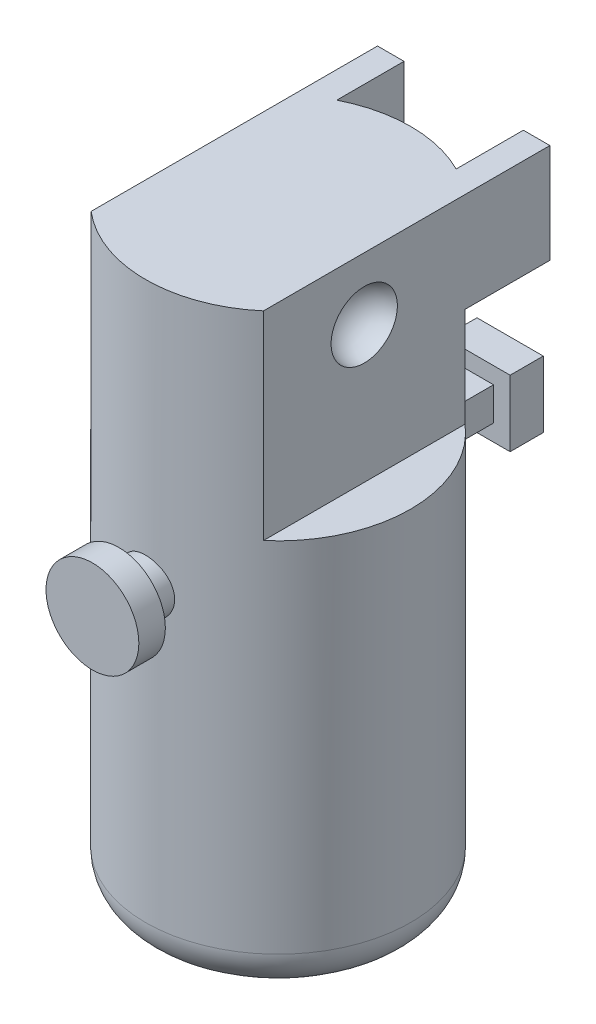
ISO-10303-21;
HEADER;
FILE_DESCRIPTION(('STEP AP214'),'2;1');
FILE_NAME('part.step','',(''),(''),'','','');
FILE_SCHEMA(('AUTOMOTIVE_DESIGN { 1 0 10303 214 1 1 1 1 }'));
ENDSEC;
DATA;
#1=APPLICATION_CONTEXT('core data for automotive mechanical design processes');
#2=APPLICATION_PROTOCOL_DEFINITION('international standard','automotive_design',2000,#1);
#3=PRODUCT_CONTEXT('',#1,'mechanical');
#4=PRODUCT('Part','Part','',(#3));
#5=PRODUCT_RELATED_PRODUCT_CATEGORY('part','',(#4));
#6=PRODUCT_DEFINITION_FORMATION('','',#4);
#7=PRODUCT_DEFINITION_CONTEXT('part definition',#1,'design');
#8=PRODUCT_DEFINITION('design','',#6,#7);
#9=PRODUCT_DEFINITION_SHAPE('','',#8);
#10=(LENGTH_UNIT() NAMED_UNIT(*) SI_UNIT(.MILLI.,.METRE.));
#11=(NAMED_UNIT(*) PLANE_ANGLE_UNIT() SI_UNIT($,.RADIAN.));
#12=(NAMED_UNIT(*) SI_UNIT($,.STERADIAN.) SOLID_ANGLE_UNIT());
#13=UNCERTAINTY_MEASURE_WITH_UNIT(LENGTH_MEASURE(1.E-05),#10,'distance_accuracy_value','');
#14=(GEOMETRIC_REPRESENTATION_CONTEXT(3) GLOBAL_UNCERTAINTY_ASSIGNED_CONTEXT((#13)) GLOBAL_UNIT_ASSIGNED_CONTEXT((#10,
#11,#12)) REPRESENTATION_CONTEXT('',''));
#15=CARTESIAN_POINT('',(0.,0.,0.));
#16=DIRECTION('',(0.,0.,1.));
#17=DIRECTION('',(1.,0.,0.));
#18=AXIS2_PLACEMENT_3D('',#15,#16,#17);
#19=CARTESIAN_POINT('',(0.,45.,0.));
#20=DIRECTION('',(0.,-1.,0.));
#21=DIRECTION('',(0.,0.,-1.));
#22=AXIS2_PLACEMENT_3D('',#19,#20,#21);
#23=CYLINDRICAL_SURFACE('',#22,10.);
#24=CARTESIAN_POINT('',(-2.,25.,9.79795897113271));
#25=CARTESIAN_POINT('',(-1.99999589175055,24.8888712490177,9.79796118053292));
#26=CARTESIAN_POINT('',(-1.99070634343629,24.7776907533333,9.79987016537404));
#27=CARTESIAN_POINT('',(-1.95382456716569,24.5584749897137,9.80728862609749));
#28=CARTESIAN_POINT('',(-1.92621769414099,24.450442310728,9.81280098289574));
#29=CARTESIAN_POINT('',(-1.85359156523949,24.2407253932916,9.82677747443709));
#30=CARTESIAN_POINT('',(-1.80858962830524,24.1390349569348,9.83523867242151));
#31=CARTESIAN_POINT('',(-1.70249821534101,23.9446503106061,9.85415598961317));
#32=CARTESIAN_POINT('',(-1.64140963720231,23.8519555989242,9.86461199746922));
#33=CARTESIAN_POINT('',(-1.50395815130688,23.6768779922923,9.88650599388505));
#34=CARTESIAN_POINT('',(-1.42741131182664,23.5946408242321,9.89795475674493));
#35=CARTESIAN_POINT('',(-1.26161357804262,23.444084932842,9.92044944605197));
#36=CARTESIAN_POINT('',(-1.17236179395597,23.3757671851656,9.93149534421663));
#37=CARTESIAN_POINT('',(-0.982722711848513,23.2544239647431,9.95205592835124));
#38=CARTESIAN_POINT('',(-0.882245135344422,23.2015369723667,9.96155642883101));
#39=CARTESIAN_POINT('',(-0.673608300774544,23.1134501259037,9.97783473767263));
#40=CARTESIAN_POINT('',(-0.565449762841107,23.078248616198,9.98461280088238));
#41=CARTESIAN_POINT('',(-0.346033546556989,23.0269856127607,9.99460641376837));
#42=CARTESIAN_POINT('',(-0.234835478429629,23.010678044858,9.99786772576254));
#43=CARTESIAN_POINT('',(-0.0112371368750724,22.9968980963234,10.0006184236721));
#44=CARTESIAN_POINT('',(0.101163019663687,22.9994239007084,10.0001081730552));
#45=CARTESIAN_POINT('',(0.322284001487178,23.0230523604311,9.99540869737031));
#46=CARTESIAN_POINT('',(0.431034428596941,23.0438899543357,9.99127196731677));
#47=CARTESIAN_POINT('',(0.643463253160604,23.1031300649178,9.97984354318817));
#48=CARTESIAN_POINT('',(0.74714144749426,23.1415332843837,9.97255172288078));
#49=CARTESIAN_POINT('',(0.947238926401776,23.2350600802945,9.95554592039917));
#50=CARTESIAN_POINT('',(1.0436083482678,23.2902875022098,9.94581696350447));
#51=CARTESIAN_POINT('',(1.22581009171951,23.4158181544732,9.92500938947571));
#52=CARTESIAN_POINT('',(1.31164119905,23.486123119541,9.91393061710444));
#53=CARTESIAN_POINT('',(1.47190286210692,23.6412672442169,9.89141928728919));
#54=CARTESIAN_POINT('',(1.54610863314726,23.7263383734592,9.87998392915032));
#55=CARTESIAN_POINT('',(1.67923698635362,23.9078328849015,9.85823143197521));
#56=CARTESIAN_POINT('',(1.7381592794555,24.0042564817664,9.84791431409096));
#57=CARTESIAN_POINT('',(1.83912562960377,24.2060416636436,9.82956094945847));
#58=CARTESIAN_POINT('',(1.88113329555542,24.3114219352793,9.82152963127098));
#59=CARTESIAN_POINT('',(1.94678068325517,24.527942647448,9.80872952642545));
#60=CARTESIAN_POINT('',(1.97042279891329,24.6390823352382,9.80396031456855));
#61=CARTESIAN_POINT('',(1.99833201207211,24.8619297159981,9.79830958535655));
#62=CARTESIAN_POINT('',(2.00292371779583,24.9735951486207,9.79736294114308));
#63=CARTESIAN_POINT('',(1.99347525662148,25.1960964463994,9.79928971377708));
#64=CARTESIAN_POINT('',(1.97943614624489,25.3069323582377,9.80216291400776));
#65=CARTESIAN_POINT('',(1.93340441614832,25.5235372805845,9.81134464989829));
#66=CARTESIAN_POINT('',(1.9015852416786,25.6293446860715,9.81761998028993));
#67=CARTESIAN_POINT('',(1.82108207061704,25.8341265580575,9.83286978703329));
#68=CARTESIAN_POINT('',(1.77239668474636,25.9331004608714,9.84184448572539));
#69=CARTESIAN_POINT('',(1.6588082844312,26.1228262199003,9.86162811924079));
#70=CARTESIAN_POINT('',(1.59370215596551,26.2134540926017,9.87245943729806));
#71=CARTESIAN_POINT('',(1.44939114442543,26.3826166240018,9.89467447653273));
#72=CARTESIAN_POINT('',(1.37018481028908,26.4611500364985,9.90605825447636));
#73=CARTESIAN_POINT('',(1.19846454699578,26.6051251183712,9.92830691738431));
#74=CARTESIAN_POINT('',(1.10576499785926,26.6703473093,9.93916115417367));
#75=CARTESIAN_POINT('',(0.910535793269509,26.7842917629992,9.9589425525724));
#76=CARTESIAN_POINT('',(0.808006550867012,26.8330147186896,9.96786979510422));
#77=CARTESIAN_POINT('',(0.596605361648025,26.9122577434933,9.98274588122133));
#78=CARTESIAN_POINT('',(0.487773346956155,26.9428810364525,9.98871158285205));
#79=CARTESIAN_POINT('',(0.266378909359822,26.9853824953277,9.99706471875323));
#80=CARTESIAN_POINT('',(0.153816937422423,26.9972629189514,9.99945258399698));
#81=CARTESIAN_POINT('',(-0.0697457878072434,27.0018539619258,10.0003708090823));
#82=CARTESIAN_POINT('',(-0.18073962428299,26.9948945609125,9.99896757098659));
#83=CARTESIAN_POINT('',(-0.399942062631302,26.9627320989043,9.99260087120678));
#84=CARTESIAN_POINT('',(-0.508150699507447,26.9375292673037,9.98763745428862));
#85=CARTESIAN_POINT('',(-0.718505499490131,26.8697420158168,9.97470996729841));
#86=CARTESIAN_POINT('',(-0.82066488648033,26.8271972437381,9.9667527449523));
#87=CARTESIAN_POINT('',(-1.01644244037214,26.7259755173378,9.9486944424736));
#88=CARTESIAN_POINT('',(-1.11005993153569,26.667297288191,9.93859319293976));
#89=CARTESIAN_POINT('',(-1.28772778021183,26.5343612258774,9.91715198313481));
#90=CARTESIAN_POINT('',(-1.37159943222968,26.4598673272325,9.90579466835802));
#91=CARTESIAN_POINT('',(-1.52576523551701,26.2978995198025,9.8832244581573));
#92=CARTESIAN_POINT('',(-1.59605616641783,26.2104225410401,9.87201159757438));
#93=CARTESIAN_POINT('',(-1.72178443889997,26.0238413666191,9.85086685467863));
#94=CARTESIAN_POINT('',(-1.77705362923618,25.9246220777575,9.84095007142451));
#95=CARTESIAN_POINT('',(-1.87004809853246,25.7181344534798,9.82370474252826));
#96=CARTESIAN_POINT('',(-1.90778929194833,25.6108735226256,9.81637385049968));
#97=CARTESIAN_POINT('',(-1.95733827971531,25.4194750891142,9.8065936227569));
#98=CARTESIAN_POINT('',(-1.97330779704737,25.3364291609721,9.80337569829212));
#99=CARTESIAN_POINT('',(-1.99464003591942,25.1689320908977,9.79905756918169));
#100=CARTESIAN_POINT('',(-2.00000312312529,25.0844809975111,9.79795729152836));
#101=CARTESIAN_POINT('',(-2.,25.,9.79795897113271));
#102=B_SPLINE_CURVE_WITH_KNOTS('',3,(#24,#25,#26,#27,#28,#29,#30,#31,#32,#33,#34,#35,#36,#37,
#38,#39,#40,#41,#42,#43,#44,#45,#46,#47,#48,#49,#50,#51,#52,#53,#54,#55,#56,#57,#58,#59,#60,#61,
#62,#63,#64,#65,#66,#67,#68,#69,#70,#71,#72,#73,#74,#75,#76,#77,#78,#79,#80,#81,#82,#83,#84,#85,
#86,#87,#88,#89,#90,#91,#92,#93,#94,#95,#96,#97,#98,#99,#100,#101),.UNSPECIFIED.,.T.,.F.,(4,2,2,
2,2,2,2,2,2,2,2,2,2,2,2,2,2,2,2,2,2,2,2,2,2,2,2,2,2,2,2,2,2,2,2,2,2,2,4),(0.,0.333076927738854,
0.666420478568594,0.999432995881169,1.33242692971973,1.66964505096874,2.00688680070844,
2.34706800874901,2.6872173649312,3.02288497766161,3.35852024232497,3.68937579267076,
4.02024458147501,4.35319848444607,4.68619071540133,5.02498693524967,5.36378956245441,
5.70331726345554,6.0428007003205,6.37647515609188,6.71013069056844,7.04058683566639,
7.37107020708798,7.70586119549044,8.04068665740419,8.38065203466903,8.72060313260211,
9.05859627157302,9.39654869383257,9.72862034829374,10.0606878273352,10.3920003415091,
10.7233390426937,11.0600230405119,11.3967867777956,11.7371779715922,12.077259501804,
12.3304760727633,12.5836839137096),.UNSPECIFIED.);
#103=CARTESIAN_POINT('',(-2.,25.,9.79795897113271));
#104=VERTEX_POINT('',#103);
#105=EDGE_CURVE('E409',#104,#104,#102,.T.);
#106=ORIENTED_EDGE('',*,*,#105,.F.);
#107=EDGE_LOOP('',(#106));
#108=FACE_BOUND('',#107,.T.);
#109=CARTESIAN_POINT('',(0.,3.,0.));
#110=DIRECTION('',(0.,1.,0.));
#111=DIRECTION('',(0.,0.,1.));
#112=AXIS2_PLACEMENT_3D('',#109,#110,#111);
#113=CIRCLE('',#112,10.);
#114=CARTESIAN_POINT('',(0.,3.,10.));
#115=VERTEX_POINT('',#114);
#116=EDGE_CURVE('E401',#115,#115,#113,.T.);
#117=ORIENTED_EDGE('',*,*,#116,.T.);
#118=EDGE_LOOP('',(#117));
#119=FACE_BOUND('',#118,.T.);
#120=DIRECTION('',(0.,-1.,0.));
#121=VECTOR('',#120,1.);
#122=CARTESIAN_POINT('',(-1.25,45.,-9.92156741649221));
#123=LINE('',#122,#121);
#124=CARTESIAN_POINT('',(-1.25,23.75,-9.92156741649221));
#125=VERTEX_POINT('',#124);
#126=CARTESIAN_POINT('',(-1.25,26.25,-9.92156741649221));
#127=VERTEX_POINT('',#126);
#128=EDGE_CURVE('E324',#125,#127,#123,.F.);
#129=ORIENTED_EDGE('',*,*,#128,.F.);
#130=CARTESIAN_POINT('',(0.,23.75,0.));
#131=DIRECTION('',(0.,1.,0.));
#132=DIRECTION('',(0.,0.,1.));
#133=AXIS2_PLACEMENT_3D('',#130,#131,#132);
#134=CIRCLE('',#133,10.);
#135=CARTESIAN_POINT('',(1.25,23.75,-9.92156741649221));
#136=VERTEX_POINT('',#135);
#137=EDGE_CURVE('E319',#125,#136,#134,.F.);
#138=ORIENTED_EDGE('',*,*,#137,.T.);
#139=DIRECTION('',(0.,-1.,0.));
#140=VECTOR('',#139,1.);
#141=CARTESIAN_POINT('',(1.25,45.,-9.92156741649221));
#142=LINE('',#141,#140);
#143=CARTESIAN_POINT('',(1.25,26.25,-9.92156741649221));
#144=VERTEX_POINT('',#143);
#145=EDGE_CURVE('E315',#136,#144,#142,.F.);
#146=ORIENTED_EDGE('',*,*,#145,.T.);
#147=CARTESIAN_POINT('',(0.,26.25,0.));
#148=DIRECTION('',(0.,1.,0.));
#149=DIRECTION('',(0.,0.,1.));
#150=AXIS2_PLACEMENT_3D('',#147,#148,#149);
#151=CIRCLE('',#150,10.);
#152=EDGE_CURVE('E320',#127,#144,#151,.F.);
#153=ORIENTED_EDGE('',*,*,#152,.F.);
#154=EDGE_LOOP('',(#129,#138,#146,#153));
#155=FACE_BOUND('',#154,.T.);
#156=CARTESIAN_POINT('',(0.,37.5,0.));
#157=DIRECTION('',(0.,1.,0.));
#158=DIRECTION('',(0.,0.,1.));
#159=AXIS2_PLACEMENT_3D('',#156,#157,#158);
#160=CIRCLE('',#159,10.);
#161=CARTESIAN_POINT('',(-4.5,37.5,-8.93028554974587));
#162=VERTEX_POINT('',#161);
#163=CARTESIAN_POINT('',(-6.5,37.5,-7.59934207678533));
#164=VERTEX_POINT('',#163);
#165=EDGE_CURVE('E13',#162,#164,#160,.T.);
#166=ORIENTED_EDGE('',*,*,#165,.F.);
#167=DIRECTION('',(0.,-1.,0.));
#168=VECTOR('',#167,1.);
#169=CARTESIAN_POINT('',(-4.5,45.,-8.93028554974587));
#170=LINE('',#169,#168);
#171=CARTESIAN_POINT('',(-4.5,45.,-8.93028554974588));
#172=VERTEX_POINT('',#171);
#173=EDGE_CURVE('E88',#172,#162,#170,.T.);
#174=ORIENTED_EDGE('',*,*,#173,.F.);
#175=CARTESIAN_POINT('',(0.,45.,0.));
#176=DIRECTION('',(0.,1.,0.));
#177=DIRECTION('',(0.,0.,1.));
#178=AXIS2_PLACEMENT_3D('',#175,#176,#177);
#179=CIRCLE('',#178,10.);
#180=CARTESIAN_POINT('',(4.5,45.,-8.93028554974588));
#181=VERTEX_POINT('',#180);
#182=EDGE_CURVE('E218',#181,#172,#179,.T.);
#183=ORIENTED_EDGE('',*,*,#182,.F.);
#184=DIRECTION('',(0.,-1.,0.));
#185=VECTOR('',#184,1.);
#186=CARTESIAN_POINT('',(4.5,45.,-8.93028554974587));
#187=LINE('',#186,#185);
#188=CARTESIAN_POINT('',(4.5,37.5,-8.93028554974588));
#189=VERTEX_POINT('',#188);
#190=EDGE_CURVE('E256',#189,#181,#187,.F.);
#191=ORIENTED_EDGE('',*,*,#190,.F.);
#192=CARTESIAN_POINT('',(0.,37.5,0.));
#193=DIRECTION('',(0.,-1.,0.));
#194=DIRECTION('',(0.,0.,-1.));
#195=AXIS2_PLACEMENT_3D('',#192,#193,#194);
#196=CIRCLE('',#195,10.);
#197=CARTESIAN_POINT('',(6.5,37.5,-7.59934207678533));
#198=VERTEX_POINT('',#197);
#199=EDGE_CURVE('E79',#189,#198,#196,.T.);
#200=ORIENTED_EDGE('',*,*,#199,.T.);
#201=DIRECTION('',(0.,-1.,0.));
#202=VECTOR('',#201,1.);
#203=CARTESIAN_POINT('',(6.5,45.,-7.59934207678533));
#204=LINE('',#203,#202);
#205=CARTESIAN_POINT('',(6.5,30.,-7.59934207678533));
#206=VERTEX_POINT('',#205);
#207=EDGE_CURVE('E367',#206,#198,#204,.F.);
#208=ORIENTED_EDGE('',*,*,#207,.F.);
#209=CARTESIAN_POINT('',(0.,30.,0.));
#210=DIRECTION('',(0.,1.,0.));
#211=DIRECTION('',(0.,0.,1.));
#212=AXIS2_PLACEMENT_3D('',#209,#210,#211);
#213=CIRCLE('',#212,10.);
#214=CARTESIAN_POINT('',(6.5,30.,7.59934207678533));
#215=VERTEX_POINT('',#214);
#216=EDGE_CURVE('E391',#215,#206,#213,.T.);
#217=ORIENTED_EDGE('',*,*,#216,.F.);
#218=DIRECTION('',(0.,-1.,0.));
#219=VECTOR('',#218,1.);
#220=CARTESIAN_POINT('',(6.5,45.,7.59934207678533));
#221=LINE('',#220,#219);
#222=CARTESIAN_POINT('',(6.5,45.,7.59934207678533));
#223=VERTEX_POINT('',#222);
#224=EDGE_CURVE('E371',#223,#215,#221,.T.);
#225=ORIENTED_EDGE('',*,*,#224,.F.);
#226=CARTESIAN_POINT('',(-6.5,45.,7.59934207678533));
#227=VERTEX_POINT('',#226);
#228=EDGE_CURVE('E381',#227,#223,#179,.T.);
#229=ORIENTED_EDGE('',*,*,#228,.F.);
#230=DIRECTION('',(0.,-1.,0.));
#231=VECTOR('',#230,1.);
#232=CARTESIAN_POINT('',(-6.5,45.,7.59934207678533));
#233=LINE('',#232,#231);
#234=CARTESIAN_POINT('',(-6.5,30.,7.59934207678533));
#235=VERTEX_POINT('',#234);
#236=EDGE_CURVE('E377',#227,#235,#233,.T.);
#237=ORIENTED_EDGE('',*,*,#236,.T.);
#238=CARTESIAN_POINT('',(-6.5,30.,-7.59934207678533));
#239=VERTEX_POINT('',#238);
#240=EDGE_CURVE('E394',#239,#235,#213,.T.);
#241=ORIENTED_EDGE('',*,*,#240,.F.);
#242=DIRECTION('',(0.,-1.,0.));
#243=VECTOR('',#242,1.);
#244=CARTESIAN_POINT('',(-6.5,45.,-7.59934207678533));
#245=LINE('',#244,#243);
#246=EDGE_CURVE('E374',#239,#164,#245,.F.);
#247=ORIENTED_EDGE('',*,*,#246,.T.);
#248=EDGE_LOOP('',(#166,#174,#183,#191,#200,#208,#217,#225,#229,#237,#241,#247));
#249=FACE_BOUND('',#248,.T.);
#250=ADVANCED_FACE('F70',(#108,#119,#155,#249),#23,.T.);
#251=CARTESIAN_POINT('',(0.,45.,0.));
#252=DIRECTION('',(0.,1.,0.));
#253=DIRECTION('',(0.,0.,1.));
#254=AXIS2_PLACEMENT_3D('',#251,#252,#253);
#255=PLANE('',#254);
#256=ORIENTED_EDGE('',*,*,#182,.T.);
#257=DIRECTION('',(0.,0.,1.));
#258=VECTOR('',#257,1.);
#259=CARTESIAN_POINT('',(-4.5,45.,-14.));
#260=LINE('',#259,#258);
#261=CARTESIAN_POINT('',(-4.5,45.,-14.));
#262=VERTEX_POINT('',#261);
#263=EDGE_CURVE('E197',#262,#172,#260,.T.);
#264=ORIENTED_EDGE('',*,*,#263,.F.);
#265=DIRECTION('',(-1.,0.,0.));
#266=VECTOR('',#265,1.);
#267=CARTESIAN_POINT('',(-4.5,45.,-14.));
#268=LINE('',#267,#266);
#269=CARTESIAN_POINT('',(-6.5,45.,-14.));
#270=VERTEX_POINT('',#269);
#271=EDGE_CURVE('E207',#262,#270,#268,.T.);
#272=ORIENTED_EDGE('',*,*,#271,.T.);
#273=DIRECTION('',(0.,0.,-1.));
#274=VECTOR('',#273,1.);
#275=CARTESIAN_POINT('',(-6.5,45.,0.));
#276=LINE('',#275,#274);
#277=EDGE_CURVE('E388',#227,#270,#276,.T.);
#278=ORIENTED_EDGE('',*,*,#277,.F.);
#279=ORIENTED_EDGE('',*,*,#228,.T.);
#280=DIRECTION('',(0.,0.,-1.));
#281=VECTOR('',#280,1.);
#282=CARTESIAN_POINT('',(6.5,45.,0.));
#283=LINE('',#282,#281);
#284=CARTESIAN_POINT('',(6.5,45.,-14.));
#285=VERTEX_POINT('',#284);
#286=EDGE_CURVE('E385',#223,#285,#283,.T.);
#287=ORIENTED_EDGE('',*,*,#286,.T.);
#288=DIRECTION('',(1.,0.,0.));
#289=VECTOR('',#288,1.);
#290=CARTESIAN_POINT('',(4.5,45.,-14.));
#291=LINE('',#290,#289);
#292=CARTESIAN_POINT('',(4.5,45.,-14.));
#293=VERTEX_POINT('',#292);
#294=EDGE_CURVE('E252',#293,#285,#291,.T.);
#295=ORIENTED_EDGE('',*,*,#294,.F.);
#296=DIRECTION('',(0.,0.,1.));
#297=VECTOR('',#296,1.);
#298=CARTESIAN_POINT('',(4.5,45.,-14.));
#299=LINE('',#298,#297);
#300=EDGE_CURVE('E234',#293,#181,#299,.T.);
#301=ORIENTED_EDGE('',*,*,#300,.T.);
#302=EDGE_LOOP('',(#256,#264,#272,#278,#279,#287,#295,#301));
#303=FACE_BOUND('',#302,.T.);
#304=ADVANCED_FACE('F216',(#303),#255,.T.);
#305=CARTESIAN_POINT('',(0.,0.,0.));
#306=DIRECTION('',(0.,1.,0.));
#307=DIRECTION('',(0.,0.,1.));
#308=AXIS2_PLACEMENT_3D('',#305,#306,#307);
#309=PLANE('',#308);
#310=CARTESIAN_POINT('',(0.,0.,0.));
#311=DIRECTION('',(0.,1.,0.));
#312=DIRECTION('',(0.,0.,1.));
#313=AXIS2_PLACEMENT_3D('',#310,#311,#312);
#314=CIRCLE('',#313,7.);
#315=CARTESIAN_POINT('',(0.,0.,7.));
#316=VERTEX_POINT('',#315);
#317=EDGE_CURVE('E405',#316,#316,#314,.F.);
#318=ORIENTED_EDGE('',*,*,#317,.T.);
#319=EDGE_LOOP('',(#318));
#320=FACE_BOUND('',#319,.T.);
#321=ADVANCED_FACE('F483',(#320),#309,.F.);
#322=CARTESIAN_POINT('',(6.5,30.,10.));
#323=DIRECTION('',(1.,0.,0.));
#324=DIRECTION('',(0.,0.,-1.));
#325=AXIS2_PLACEMENT_3D('',#322,#323,#324);
#326=PLANE('',#325);
#327=CARTESIAN_POINT('',(6.5,40.2924092014202,0.));
#328=DIRECTION('',(1.,0.,0.));
#329=DIRECTION('',(0.,0.,-1.));
#330=AXIS2_PLACEMENT_3D('',#327,#328,#329);
#331=CIRCLE('',#330,2.5);
#332=CARTESIAN_POINT('',(6.5,40.2924092014202,-2.5));
#333=VERTEX_POINT('',#332);
#334=EDGE_CURVE('E348',#333,#333,#331,.T.);
#335=ORIENTED_EDGE('',*,*,#334,.F.);
#336=EDGE_LOOP('',(#335));
#337=FACE_BOUND('',#336,.T.);
#338=ORIENTED_EDGE('',*,*,#224,.T.);
#339=DIRECTION('',(0.,0.,-1.));
#340=VECTOR('',#339,1.);
#341=CARTESIAN_POINT('',(6.5,30.,10.));
#342=LINE('',#341,#340);
#343=EDGE_CURVE('E358',#215,#206,#342,.T.);
#344=ORIENTED_EDGE('',*,*,#343,.T.);
#345=ORIENTED_EDGE('',*,*,#207,.T.);
#346=DIRECTION('',(0.,0.,-1.));
#347=VECTOR('',#346,1.);
#348=CARTESIAN_POINT('',(6.5,37.5,-14.));
#349=LINE('',#348,#347);
#350=CARTESIAN_POINT('',(6.5,37.5,-14.));
#351=VERTEX_POINT('',#350);
#352=EDGE_CURVE('E233',#198,#351,#349,.T.);
#353=ORIENTED_EDGE('',*,*,#352,.T.);
#354=DIRECTION('',(0.,1.,0.));
#355=VECTOR('',#354,1.);
#356=CARTESIAN_POINT('',(6.5,45.,-14.));
#357=LINE('',#356,#355);
#358=EDGE_CURVE('E238',#351,#285,#357,.T.);
#359=ORIENTED_EDGE('',*,*,#358,.T.);
#360=ORIENTED_EDGE('',*,*,#286,.F.);
#361=EDGE_LOOP('',(#338,#344,#345,#353,#359,#360));
#362=FACE_BOUND('',#361,.T.);
#363=ADVANCED_FACE('F479',(#337,#362),#326,.T.);
#364=CARTESIAN_POINT('',(0.,30.,0.));
#365=DIRECTION('',(0.,1.,0.));
#366=DIRECTION('',(0.,0.,1.));
#367=AXIS2_PLACEMENT_3D('',#364,#365,#366);
#368=PLANE('',#367);
#369=ORIENTED_EDGE('',*,*,#216,.T.);
#370=ORIENTED_EDGE('',*,*,#343,.F.);
#371=EDGE_LOOP('',(#369,#370));
#372=FACE_BOUND('',#371,.T.);
#373=ADVANCED_FACE('F482',(#372),#368,.T.);
#374=ORIENTED_EDGE('',*,*,#240,.T.);
#375=DIRECTION('',(0.,0.,-1.));
#376=VECTOR('',#375,1.);
#377=CARTESIAN_POINT('',(-6.5,30.,10.));
#378=LINE('',#377,#376);
#379=EDGE_CURVE('E362',#235,#239,#378,.T.);
#380=ORIENTED_EDGE('',*,*,#379,.T.);
#381=EDGE_LOOP('',(#374,#380));
#382=FACE_BOUND('',#381,.T.);
#383=ADVANCED_FACE('F477',(#382),#368,.T.);
#384=CARTESIAN_POINT('',(-6.5,30.,10.));
#385=DIRECTION('',(1.,0.,0.));
#386=DIRECTION('',(0.,0.,-1.));
#387=AXIS2_PLACEMENT_3D('',#384,#385,#386);
#388=PLANE('',#387);
#389=CARTESIAN_POINT('',(-6.5,40.2924092014202,0.));
#390=DIRECTION('',(1.,0.,0.));
#391=DIRECTION('',(0.,0.,-1.));
#392=AXIS2_PLACEMENT_3D('',#389,#390,#391);
#393=CIRCLE('',#392,2.5);
#394=CARTESIAN_POINT('',(-6.5,40.2924092014202,-2.5));
#395=VERTEX_POINT('',#394);
#396=EDGE_CURVE('E363',#395,#395,#393,.T.);
#397=ORIENTED_EDGE('',*,*,#396,.T.);
#398=EDGE_LOOP('',(#397));
#399=FACE_BOUND('',#398,.T.);
#400=ORIENTED_EDGE('',*,*,#277,.T.);
#401=DIRECTION('',(0.,1.,0.));
#402=VECTOR('',#401,1.);
#403=CARTESIAN_POINT('',(-6.5,45.,-14.));
#404=LINE('',#403,#402);
#405=CARTESIAN_POINT('',(-6.5,37.5,-14.));
#406=VERTEX_POINT('',#405);
#407=EDGE_CURVE('E210',#406,#270,#404,.T.);
#408=ORIENTED_EDGE('',*,*,#407,.F.);
#409=DIRECTION('',(0.,0.,-1.));
#410=VECTOR('',#409,1.);
#411=CARTESIAN_POINT('',(-6.5,37.5,-14.));
#412=LINE('',#411,#410);
#413=EDGE_CURVE('E220',#164,#406,#412,.T.);
#414=ORIENTED_EDGE('',*,*,#413,.F.);
#415=ORIENTED_EDGE('',*,*,#246,.F.);
#416=ORIENTED_EDGE('',*,*,#379,.F.);
#417=ORIENTED_EDGE('',*,*,#236,.F.);
#418=EDGE_LOOP('',(#400,#408,#414,#415,#416,#417));
#419=FACE_BOUND('',#418,.T.);
#420=ADVANCED_FACE('F473',(#399,#419),#388,.F.);
#421=CARTESIAN_POINT('',(-6.5,40.2924092014202,0.));
#422=DIRECTION('',(0.,1.,0.));
#423=DIRECTION('',(0.,0.,-1.));
#424=AXIS2_PLACEMENT_3D('',#421,#422,#423);
#425=SPHERICAL_SURFACE('',#424,2.5);
#426=CARTESIAN_POINT('',(-6.5,40.2924092014202,0.));
#427=DIRECTION('',(1.,0.,0.));
#428=DIRECTION('',(0.,0.,-1.));
#429=AXIS2_PLACEMENT_3D('',#426,#427,#428);
#430=SPHERICAL_SURFACE('',#429,2.5);
#431=ORIENTED_EDGE('',*,*,#396,.F.);
#432=EDGE_LOOP('',(#431));
#433=FACE_BOUND('',#432,.T.);
#434=ADVANCED_FACE('F469',(#433),#430,.F.);
#435=CARTESIAN_POINT('',(6.5,40.2924092014202,0.));
#436=DIRECTION('',(0.,1.,0.));
#437=DIRECTION('',(0.,0.,-1.));
#438=AXIS2_PLACEMENT_3D('',#435,#436,#437);
#439=SPHERICAL_SURFACE('',#438,2.5);
#440=CARTESIAN_POINT('',(6.5,40.2924092014202,0.));
#441=DIRECTION('',(1.,0.,0.));
#442=DIRECTION('',(0.,0.,-1.));
#443=AXIS2_PLACEMENT_3D('',#440,#441,#442);
#444=SPHERICAL_SURFACE('',#443,2.5);
#445=ORIENTED_EDGE('',*,*,#334,.T.);
#446=EDGE_LOOP('',(#445));
#447=FACE_BOUND('',#446,.T.);
#448=ADVANCED_FACE('F466',(#447),#444,.F.);
#449=CARTESIAN_POINT('',(0.,3.,0.));
#450=DIRECTION('',(0.,1.,0.));
#451=DIRECTION('',(0.,0.,1.));
#452=AXIS2_PLACEMENT_3D('',#449,#450,#451);
#453=TOROIDAL_SURFACE('',#452,7.,3.);
#454=ORIENTED_EDGE('',*,*,#317,.F.);
#455=EDGE_LOOP('',(#454));
#456=FACE_BOUND('',#455,.T.);
#457=ORIENTED_EDGE('',*,*,#116,.F.);
#458=EDGE_LOOP('',(#457));
#459=FACE_BOUND('',#458,.T.);
#460=ADVANCED_FACE('F72',(#456,#459),#453,.T.);
#461=CARTESIAN_POINT('',(-1.25,23.75,-15.));
#462=DIRECTION('',(0.,-1.,0.));
#463=DIRECTION('',(0.,0.,-1.));
#464=AXIS2_PLACEMENT_3D('',#461,#462,#463);
#465=PLANE('',#464);
#466=DIRECTION('',(0.,0.,1.));
#467=VECTOR('',#466,1.);
#468=CARTESIAN_POINT('',(1.25,23.75,-15.));
#469=LINE('',#468,#467);
#470=CARTESIAN_POINT('',(1.25,23.75,-15.));
#471=VERTEX_POINT('',#470);
#472=EDGE_CURVE('E344',#471,#136,#469,.T.);
#473=ORIENTED_EDGE('',*,*,#472,.T.);
#474=ORIENTED_EDGE('',*,*,#137,.F.);
#475=DIRECTION('',(0.,0.,1.));
#476=VECTOR('',#475,1.);
#477=CARTESIAN_POINT('',(-1.25,23.75,-15.));
#478=LINE('',#477,#476);
#479=CARTESIAN_POINT('',(-1.25,23.75,-15.));
#480=VERTEX_POINT('',#479);
#481=EDGE_CURVE('E345',#480,#125,#478,.T.);
#482=ORIENTED_EDGE('',*,*,#481,.F.);
#483=DIRECTION('',(1.,0.,0.));
#484=VECTOR('',#483,1.);
#485=CARTESIAN_POINT('',(-1.25,23.75,-15.));
#486=LINE('',#485,#484);
#487=EDGE_CURVE('E323',#480,#471,#486,.T.);
#488=ORIENTED_EDGE('',*,*,#487,.T.);
#489=EDGE_LOOP('',(#473,#474,#482,#488));
#490=FACE_BOUND('',#489,.T.);
#491=ADVANCED_FACE('F455',(#490),#465,.T.);
#492=CARTESIAN_POINT('',(-1.25,23.75,-15.));
#493=DIRECTION('',(1.,0.,0.));
#494=DIRECTION('',(0.,0.,-1.));
#495=AXIS2_PLACEMENT_3D('',#492,#493,#494);
#496=PLANE('',#495);
#497=ORIENTED_EDGE('',*,*,#481,.T.);
#498=ORIENTED_EDGE('',*,*,#128,.T.);
#499=DIRECTION('',(0.,0.,1.));
#500=VECTOR('',#499,1.);
#501=CARTESIAN_POINT('',(-1.25,26.25,-15.));
#502=LINE('',#501,#500);
#503=CARTESIAN_POINT('',(-1.25,26.25,-15.));
#504=VERTEX_POINT('',#503);
#505=EDGE_CURVE('E349',#504,#127,#502,.T.);
#506=ORIENTED_EDGE('',*,*,#505,.F.);
#507=DIRECTION('',(0.,1.,0.));
#508=VECTOR('',#507,1.);
#509=CARTESIAN_POINT('',(-1.25,23.75,-15.));
#510=LINE('',#509,#508);
#511=EDGE_CURVE('E341',#480,#504,#510,.T.);
#512=ORIENTED_EDGE('',*,*,#511,.F.);
#513=EDGE_LOOP('',(#497,#498,#506,#512));
#514=FACE_BOUND('',#513,.T.);
#515=ADVANCED_FACE('F451',(#514),#496,.F.);
#516=CARTESIAN_POINT('',(-1.25,26.25,-15.));
#517=DIRECTION('',(0.,-1.,0.));
#518=DIRECTION('',(0.,0.,-1.));
#519=AXIS2_PLACEMENT_3D('',#516,#517,#518);
#520=PLANE('',#519);
#521=ORIENTED_EDGE('',*,*,#505,.T.);
#522=ORIENTED_EDGE('',*,*,#152,.T.);
#523=DIRECTION('',(0.,0.,1.));
#524=VECTOR('',#523,1.);
#525=CARTESIAN_POINT('',(1.25,26.25,-15.));
#526=LINE('',#525,#524);
#527=CARTESIAN_POINT('',(1.25,26.25,-15.));
#528=VERTEX_POINT('',#527);
#529=EDGE_CURVE('E352',#528,#144,#526,.T.);
#530=ORIENTED_EDGE('',*,*,#529,.F.);
#531=DIRECTION('',(1.,0.,0.));
#532=VECTOR('',#531,1.);
#533=CARTESIAN_POINT('',(-1.25,26.25,-15.));
#534=LINE('',#533,#532);
#535=EDGE_CURVE('E338',#504,#528,#534,.T.);
#536=ORIENTED_EDGE('',*,*,#535,.F.);
#537=EDGE_LOOP('',(#521,#522,#530,#536));
#538=FACE_BOUND('',#537,.T.);
#539=ADVANCED_FACE('F454',(#538),#520,.F.);
#540=CARTESIAN_POINT('',(1.25,23.75,-15.));
#541=DIRECTION('',(1.,0.,0.));
#542=DIRECTION('',(0.,0.,-1.));
#543=AXIS2_PLACEMENT_3D('',#540,#541,#542);
#544=PLANE('',#543);
#545=ORIENTED_EDGE('',*,*,#529,.T.);
#546=ORIENTED_EDGE('',*,*,#145,.F.);
#547=ORIENTED_EDGE('',*,*,#472,.F.);
#548=DIRECTION('',(0.,1.,0.));
#549=VECTOR('',#548,1.);
#550=CARTESIAN_POINT('',(1.25,23.75,-15.));
#551=LINE('',#550,#549);
#552=EDGE_CURVE('E334',#471,#528,#551,.T.);
#553=ORIENTED_EDGE('',*,*,#552,.T.);
#554=EDGE_LOOP('',(#545,#546,#547,#553));
#555=FACE_BOUND('',#554,.T.);
#556=ADVANCED_FACE('F435',(#555),#544,.T.);
#557=CARTESIAN_POINT('',(0.,0.,-15.));
#558=DIRECTION('',(0.,0.,1.));
#559=DIRECTION('',(1.,0.,0.));
#560=AXIS2_PLACEMENT_3D('',#557,#558,#559);
#561=PLANE('',#560);
#562=DIRECTION('',(0.,1.,0.));
#563=VECTOR('',#562,1.);
#564=CARTESIAN_POINT('',(-2.5,22.5,-15.));
#565=LINE('',#564,#563);
#566=CARTESIAN_POINT('',(-2.5,22.5,-15.));
#567=VERTEX_POINT('',#566);
#568=CARTESIAN_POINT('',(-2.5,27.5,-15.));
#569=VERTEX_POINT('',#568);
#570=EDGE_CURVE('E273',#567,#569,#565,.T.);
#571=ORIENTED_EDGE('',*,*,#570,.F.);
#572=DIRECTION('',(-1.,0.,0.));
#573=VECTOR('',#572,1.);
#574=CARTESIAN_POINT('',(2.5,22.5,-15.));
#575=LINE('',#574,#573);
#576=CARTESIAN_POINT('',(2.5,22.5,-15.));
#577=VERTEX_POINT('',#576);
#578=EDGE_CURVE('E279',#577,#567,#575,.T.);
#579=ORIENTED_EDGE('',*,*,#578,.F.);
#580=DIRECTION('',(0.,-1.,0.));
#581=VECTOR('',#580,1.);
#582=CARTESIAN_POINT('',(2.5,22.5,-15.));
#583=LINE('',#582,#581);
#584=CARTESIAN_POINT('',(2.5,27.5,-15.));
#585=VERTEX_POINT('',#584);
#586=EDGE_CURVE('E295',#585,#577,#583,.T.);
#587=ORIENTED_EDGE('',*,*,#586,.F.);
#588=DIRECTION('',(1.,0.,0.));
#589=VECTOR('',#588,1.);
#590=CARTESIAN_POINT('',(2.5,27.5,-15.));
#591=LINE('',#590,#589);
#592=EDGE_CURVE('E292',#569,#585,#591,.T.);
#593=ORIENTED_EDGE('',*,*,#592,.F.);
#594=EDGE_LOOP('',(#571,#579,#587,#593));
#595=FACE_BOUND('',#594,.T.);
#596=ORIENTED_EDGE('',*,*,#487,.F.);
#597=ORIENTED_EDGE('',*,*,#511,.T.);
#598=ORIENTED_EDGE('',*,*,#535,.T.);
#599=ORIENTED_EDGE('',*,*,#552,.F.);
#600=EDGE_LOOP('',(#596,#597,#598,#599));
#601=FACE_BOUND('',#600,.T.);
#602=ADVANCED_FACE('F431',(#595,#601),#561,.T.);
#603=CARTESIAN_POINT('',(-2.5,22.5,-17.5));
#604=DIRECTION('',(1.,0.,0.));
#605=DIRECTION('',(0.,0.,-1.));
#606=AXIS2_PLACEMENT_3D('',#603,#604,#605);
#607=PLANE('',#606);
#608=ORIENTED_EDGE('',*,*,#570,.T.);
#609=DIRECTION('',(0.,0.,1.));
#610=VECTOR('',#609,1.);
#611=CARTESIAN_POINT('',(-2.5,27.5,-17.5));
#612=LINE('',#611,#610);
#613=CARTESIAN_POINT('',(-2.5,27.5,-17.5));
#614=VERTEX_POINT('',#613);
#615=EDGE_CURVE('E311',#614,#569,#612,.T.);
#616=ORIENTED_EDGE('',*,*,#615,.F.);
#617=DIRECTION('',(0.,1.,0.));
#618=VECTOR('',#617,1.);
#619=CARTESIAN_POINT('',(-2.5,22.5,-17.5));
#620=LINE('',#619,#618);
#621=CARTESIAN_POINT('',(-2.5,22.5,-17.5));
#622=VERTEX_POINT('',#621);
#623=EDGE_CURVE('E274',#622,#614,#620,.T.);
#624=ORIENTED_EDGE('',*,*,#623,.F.);
#625=DIRECTION('',(0.,0.,1.));
#626=VECTOR('',#625,1.);
#627=CARTESIAN_POINT('',(-2.5,22.5,-17.5));
#628=LINE('',#627,#626);
#629=EDGE_CURVE('E288',#622,#567,#628,.T.);
#630=ORIENTED_EDGE('',*,*,#629,.T.);
#631=EDGE_LOOP('',(#608,#616,#624,#630));
#632=FACE_BOUND('',#631,.T.);
#633=ADVANCED_FACE('F434',(#632),#607,.F.);
#634=CARTESIAN_POINT('',(2.5,27.5,-17.5));
#635=DIRECTION('',(0.,-1.,0.));
#636=DIRECTION('',(0.,0.,-1.));
#637=AXIS2_PLACEMENT_3D('',#634,#635,#636);
#638=PLANE('',#637);
#639=ORIENTED_EDGE('',*,*,#592,.T.);
#640=DIRECTION('',(0.,0.,1.));
#641=VECTOR('',#640,1.);
#642=CARTESIAN_POINT('',(2.5,27.5,-17.5));
#643=LINE('',#642,#641);
#644=CARTESIAN_POINT('',(2.5,27.5,-17.5));
#645=VERTEX_POINT('',#644);
#646=EDGE_CURVE('E307',#645,#585,#643,.T.);
#647=ORIENTED_EDGE('',*,*,#646,.F.);
#648=DIRECTION('',(1.,0.,0.));
#649=VECTOR('',#648,1.);
#650=CARTESIAN_POINT('',(2.5,27.5,-17.5));
#651=LINE('',#650,#649);
#652=EDGE_CURVE('E278',#614,#645,#651,.T.);
#653=ORIENTED_EDGE('',*,*,#652,.F.);
#654=ORIENTED_EDGE('',*,*,#615,.T.);
#655=EDGE_LOOP('',(#639,#647,#653,#654));
#656=FACE_BOUND('',#655,.T.);
#657=ADVANCED_FACE('F443',(#656),#638,.F.);
#658=CARTESIAN_POINT('',(2.5,22.5,-17.5));
#659=DIRECTION('',(-1.,0.,0.));
#660=DIRECTION('',(0.,0.,1.));
#661=AXIS2_PLACEMENT_3D('',#658,#659,#660);
#662=PLANE('',#661);
#663=ORIENTED_EDGE('',*,*,#586,.T.);
#664=DIRECTION('',(0.,0.,1.));
#665=VECTOR('',#664,1.);
#666=CARTESIAN_POINT('',(2.5,22.5,-17.5));
#667=LINE('',#666,#665);
#668=CARTESIAN_POINT('',(2.5,22.5,-17.5));
#669=VERTEX_POINT('',#668);
#670=EDGE_CURVE('E303',#669,#577,#667,.T.);
#671=ORIENTED_EDGE('',*,*,#670,.F.);
#672=DIRECTION('',(0.,-1.,0.));
#673=VECTOR('',#672,1.);
#674=CARTESIAN_POINT('',(2.5,22.5,-17.5));
#675=LINE('',#674,#673);
#676=EDGE_CURVE('E282',#645,#669,#675,.T.);
#677=ORIENTED_EDGE('',*,*,#676,.F.);
#678=ORIENTED_EDGE('',*,*,#646,.T.);
#679=EDGE_LOOP('',(#663,#671,#677,#678));
#680=FACE_BOUND('',#679,.T.);
#681=ADVANCED_FACE('F439',(#680),#662,.F.);
#682=CARTESIAN_POINT('',(2.5,22.5,-17.5));
#683=DIRECTION('',(0.,1.,0.));
#684=DIRECTION('',(0.,0.,1.));
#685=AXIS2_PLACEMENT_3D('',#682,#683,#684);
#686=PLANE('',#685);
#687=ORIENTED_EDGE('',*,*,#578,.T.);
#688=ORIENTED_EDGE('',*,*,#629,.F.);
#689=DIRECTION('',(-1.,0.,0.));
#690=VECTOR('',#689,1.);
#691=CARTESIAN_POINT('',(2.5,22.5,-17.5));
#692=LINE('',#691,#690);
#693=EDGE_CURVE('E285',#669,#622,#692,.T.);
#694=ORIENTED_EDGE('',*,*,#693,.F.);
#695=ORIENTED_EDGE('',*,*,#670,.T.);
#696=EDGE_LOOP('',(#687,#688,#694,#695));
#697=FACE_BOUND('',#696,.T.);
#698=ADVANCED_FACE('F429',(#697),#686,.F.);
#699=CARTESIAN_POINT('',(0.,0.,-17.5));
#700=DIRECTION('',(0.,0.,1.));
#701=DIRECTION('',(1.,0.,0.));
#702=AXIS2_PLACEMENT_3D('',#699,#700,#701);
#703=PLANE('',#702);
#704=ORIENTED_EDGE('',*,*,#623,.T.);
#705=ORIENTED_EDGE('',*,*,#652,.T.);
#706=ORIENTED_EDGE('',*,*,#676,.T.);
#707=ORIENTED_EDGE('',*,*,#693,.T.);
#708=EDGE_LOOP('',(#704,#705,#706,#707));
#709=FACE_BOUND('',#708,.T.);
#710=ADVANCED_FACE('F424',(#709),#703,.F.);
#711=CARTESIAN_POINT('',(0.,25.,12.));
#712=DIRECTION('',(0.,0.,-1.));
#713=DIRECTION('',(-1.,0.,0.));
#714=AXIS2_PLACEMENT_3D('',#711,#712,#713);
#715=CYLINDRICAL_SURFACE('',#714,2.);
#716=CARTESIAN_POINT('',(0.,25.,12.));
#717=DIRECTION('',(0.,0.,1.));
#718=DIRECTION('',(1.,0.,0.));
#719=AXIS2_PLACEMENT_3D('',#716,#717,#718);
#720=CIRCLE('',#719,2.);
#721=CARTESIAN_POINT('',(2.,25.,12.));
#722=VERTEX_POINT('',#721);
#723=EDGE_CURVE('E266',#722,#722,#720,.T.);
#724=ORIENTED_EDGE('',*,*,#723,.F.);
#725=EDGE_LOOP('',(#724));
#726=FACE_BOUND('',#725,.T.);
#727=ORIENTED_EDGE('',*,*,#105,.T.);
#728=EDGE_LOOP('',(#727));
#729=FACE_BOUND('',#728,.T.);
#730=ADVANCED_FACE('F418',(#726,#729),#715,.T.);
#731=CARTESIAN_POINT('',(0.,24.9951654924981,14.));
#732=DIRECTION('',(0.,0.,-1.));
#733=DIRECTION('',(-1.,0.,0.));
#734=AXIS2_PLACEMENT_3D('',#731,#732,#733);
#735=CYLINDRICAL_SURFACE('',#734,3.5);
#736=CARTESIAN_POINT('',(0.,24.9951654924981,14.));
#737=DIRECTION('',(0.,0.,1.));
#738=DIRECTION('',(1.,0.,0.));
#739=AXIS2_PLACEMENT_3D('',#736,#737,#738);
#740=CIRCLE('',#739,3.5);
#741=CARTESIAN_POINT('',(3.5,24.9951654924981,14.));
#742=VERTEX_POINT('',#741);
#743=EDGE_CURVE('E262',#742,#742,#740,.T.);
#744=ORIENTED_EDGE('',*,*,#743,.F.);
#745=EDGE_LOOP('',(#744));
#746=FACE_BOUND('',#745,.T.);
#747=CARTESIAN_POINT('',(0.,24.9951654924981,12.));
#748=DIRECTION('',(0.,0.,1.));
#749=DIRECTION('',(1.,0.,0.));
#750=AXIS2_PLACEMENT_3D('',#747,#748,#749);
#751=CIRCLE('',#750,3.5);
#752=CARTESIAN_POINT('',(3.5,24.9951654924981,12.));
#753=VERTEX_POINT('',#752);
#754=EDGE_CURVE('E261',#753,#753,#751,.T.);
#755=ORIENTED_EDGE('',*,*,#754,.T.);
#756=EDGE_LOOP('',(#755));
#757=FACE_BOUND('',#756,.T.);
#758=ADVANCED_FACE('F423',(#746,#757),#735,.T.);
#759=CARTESIAN_POINT('',(0.,24.9951654924981,14.));
#760=DIRECTION('',(0.,0.,1.));
#761=DIRECTION('',(1.,0.,0.));
#762=AXIS2_PLACEMENT_3D('',#759,#760,#761);
#763=PLANE('',#762);
#764=ORIENTED_EDGE('',*,*,#743,.T.);
#765=EDGE_LOOP('',(#764));
#766=FACE_BOUND('',#765,.T.);
#767=ADVANCED_FACE('F582',(#766),#763,.T.);
#768=CARTESIAN_POINT('',(0.,24.9951654924981,12.));
#769=DIRECTION('',(0.,0.,1.));
#770=DIRECTION('',(1.,0.,0.));
#771=AXIS2_PLACEMENT_3D('',#768,#769,#770);
#772=PLANE('',#771);
#773=ORIENTED_EDGE('',*,*,#723,.T.);
#774=EDGE_LOOP('',(#773));
#775=FACE_BOUND('',#774,.T.);
#776=ORIENTED_EDGE('',*,*,#754,.F.);
#777=EDGE_LOOP('',(#776));
#778=FACE_BOUND('',#777,.T.);
#779=ADVANCED_FACE('F590',(#775,#778),#772,.F.);
#780=CARTESIAN_POINT('',(4.5,0.,0.));
#781=DIRECTION('',(1.,0.,0.));
#782=DIRECTION('',(0.,0.,-1.));
#783=AXIS2_PLACEMENT_3D('',#780,#781,#782);
#784=PLANE('',#783);
#785=DIRECTION('',(0.,0.,-1.));
#786=VECTOR('',#785,1.);
#787=CARTESIAN_POINT('',(4.5,37.5,-14.));
#788=LINE('',#787,#786);
#789=CARTESIAN_POINT('',(4.5,37.5,-14.));
#790=VERTEX_POINT('',#789);
#791=EDGE_CURVE('E237',#189,#790,#788,.T.);
#792=ORIENTED_EDGE('',*,*,#791,.F.);
#793=ORIENTED_EDGE('',*,*,#190,.T.);
#794=ORIENTED_EDGE('',*,*,#300,.F.);
#795=DIRECTION('',(0.,1.,0.));
#796=VECTOR('',#795,1.);
#797=CARTESIAN_POINT('',(4.5,45.,-14.));
#798=LINE('',#797,#796);
#799=EDGE_CURVE('E241',#790,#293,#798,.T.);
#800=ORIENTED_EDGE('',*,*,#799,.F.);
#801=EDGE_LOOP('',(#792,#793,#794,#800));
#802=FACE_BOUND('',#801,.T.);
#803=ADVANCED_FACE('F598',(#802),#784,.F.);
#804=CARTESIAN_POINT('',(4.5,45.,-14.));
#805=DIRECTION('',(0.,0.,-1.));
#806=DIRECTION('',(-1.,0.,0.));
#807=AXIS2_PLACEMENT_3D('',#804,#805,#806);
#808=PLANE('',#807);
#809=ORIENTED_EDGE('',*,*,#358,.F.);
#810=DIRECTION('',(1.,0.,0.));
#811=VECTOR('',#810,1.);
#812=CARTESIAN_POINT('',(4.5,37.5,-14.));
#813=LINE('',#812,#811);
#814=EDGE_CURVE('E245',#790,#351,#813,.T.);
#815=ORIENTED_EDGE('',*,*,#814,.F.);
#816=ORIENTED_EDGE('',*,*,#799,.T.);
#817=ORIENTED_EDGE('',*,*,#294,.T.);
#818=EDGE_LOOP('',(#809,#815,#816,#817));
#819=FACE_BOUND('',#818,.T.);
#820=ADVANCED_FACE('F613',(#819),#808,.T.);
#821=CARTESIAN_POINT('',(4.5,37.5,-14.));
#822=DIRECTION('',(0.,-1.,0.));
#823=DIRECTION('',(0.,0.,-1.));
#824=AXIS2_PLACEMENT_3D('',#821,#822,#823);
#825=PLANE('',#824);
#826=ORIENTED_EDGE('',*,*,#199,.F.);
#827=ORIENTED_EDGE('',*,*,#791,.T.);
#828=ORIENTED_EDGE('',*,*,#814,.T.);
#829=ORIENTED_EDGE('',*,*,#352,.F.);
#830=EDGE_LOOP('',(#826,#827,#828,#829));
#831=FACE_BOUND('',#830,.T.);
#832=ADVANCED_FACE('F621',(#831),#825,.T.);
#833=CARTESIAN_POINT('',(-4.5,0.,0.));
#834=DIRECTION('',(-1.,0.,0.));
#835=DIRECTION('',(0.,0.,-1.));
#836=AXIS2_PLACEMENT_3D('',#833,#834,#835);
#837=PLANE('',#836);
#838=ORIENTED_EDGE('',*,*,#263,.T.);
#839=ORIENTED_EDGE('',*,*,#173,.T.);
#840=DIRECTION('',(0.,0.,-1.));
#841=VECTOR('',#840,1.);
#842=CARTESIAN_POINT('',(-4.5,37.5,-14.));
#843=LINE('',#842,#841);
#844=CARTESIAN_POINT('',(-4.5,37.5,-14.));
#845=VERTEX_POINT('',#844);
#846=EDGE_CURVE('E199',#162,#845,#843,.T.);
#847=ORIENTED_EDGE('',*,*,#846,.T.);
#848=DIRECTION('',(0.,1.,0.));
#849=VECTOR('',#848,1.);
#850=CARTESIAN_POINT('',(-4.5,45.,-14.));
#851=LINE('',#850,#849);
#852=EDGE_CURVE('E193',#845,#262,#851,.T.);
#853=ORIENTED_EDGE('',*,*,#852,.T.);
#854=EDGE_LOOP('',(#838,#839,#847,#853));
#855=FACE_BOUND('',#854,.T.);
#856=ADVANCED_FACE('F195',(#855),#837,.F.);
#857=CARTESIAN_POINT('',(-4.5,37.5,-14.));
#858=DIRECTION('',(0.,1.,0.));
#859=DIRECTION('',(0.,0.,1.));
#860=AXIS2_PLACEMENT_3D('',#857,#858,#859);
#861=PLANE('',#860);
#862=ORIENTED_EDGE('',*,*,#846,.F.);
#863=ORIENTED_EDGE('',*,*,#165,.T.);
#864=ORIENTED_EDGE('',*,*,#413,.T.);
#865=DIRECTION('',(-1.,0.,0.));
#866=VECTOR('',#865,1.);
#867=CARTESIAN_POINT('',(-4.5,37.5,-14.));
#868=LINE('',#867,#866);
#869=EDGE_CURVE('E214',#845,#406,#868,.T.);
#870=ORIENTED_EDGE('',*,*,#869,.F.);
#871=EDGE_LOOP('',(#862,#863,#864,#870));
#872=FACE_BOUND('',#871,.T.);
#873=ADVANCED_FACE('F662',(#872),#861,.F.);
#874=CARTESIAN_POINT('',(-4.5,45.,-14.));
#875=DIRECTION('',(0.,0.,1.));
#876=DIRECTION('',(1.,0.,0.));
#877=AXIS2_PLACEMENT_3D('',#874,#875,#876);
#878=PLANE('',#877);
#879=ORIENTED_EDGE('',*,*,#407,.T.);
#880=ORIENTED_EDGE('',*,*,#271,.F.);
#881=ORIENTED_EDGE('',*,*,#852,.F.);
#882=ORIENTED_EDGE('',*,*,#869,.T.);
#883=EDGE_LOOP('',(#879,#880,#881,#882));
#884=FACE_BOUND('',#883,.T.);
#885=ADVANCED_FACE('F208',(#884),#878,.F.);
#886=CLOSED_SHELL('',(#250,#304,#321,#363,#373,#383,#420,#434,#448,#460,#491,#515,#539,#556,
#602,#633,#657,#681,#698,#710,#730,#758,#767,#779,#803,#820,#832,#856,#873,#885));
#887=MANIFOLD_SOLID_BREP('B2',#886);
#888=ADVANCED_BREP_SHAPE_REPRESENTATION('',(#18,#887),#14);
#889=SHAPE_DEFINITION_REPRESENTATION(#9,#888);
ENDSEC;
END-ISO-10303-21;
